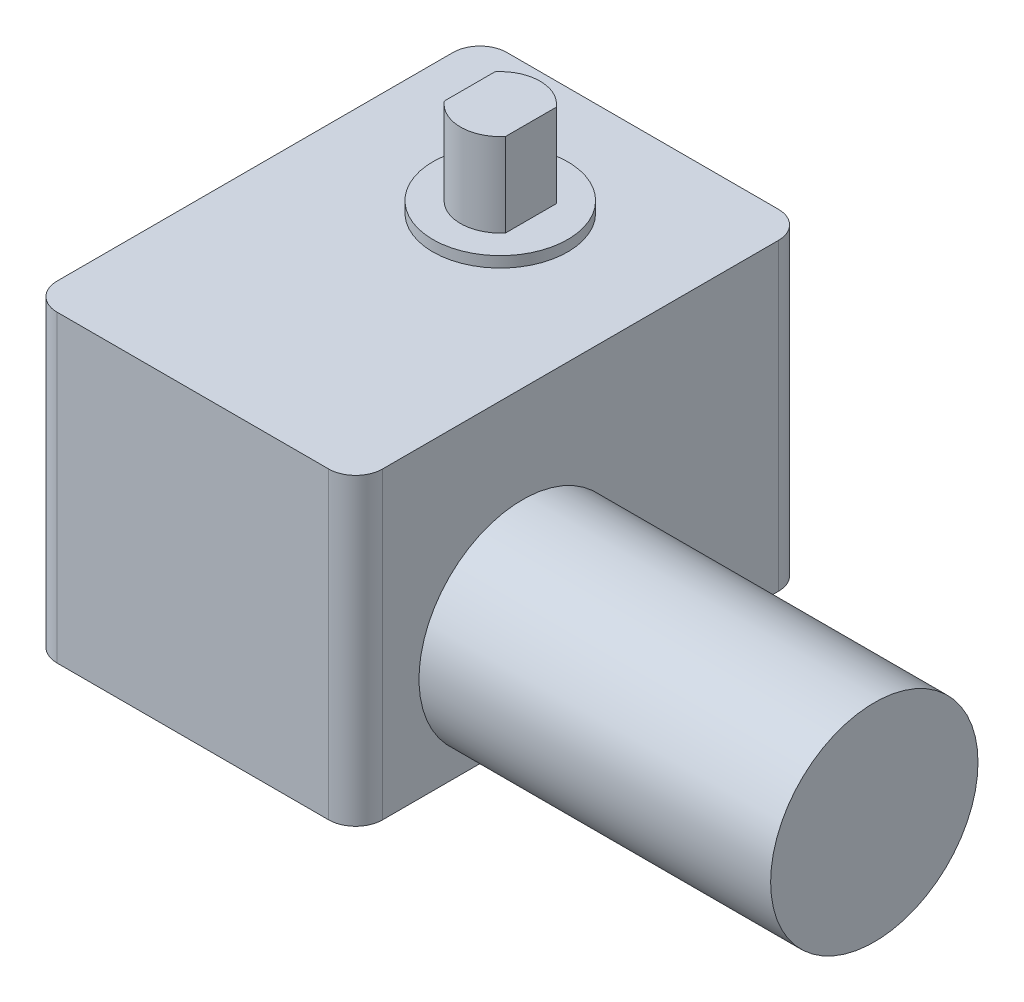
ISO-10303-21;
HEADER;
FILE_DESCRIPTION(('STEP AP214'),'2;1');
FILE_NAME('part.step','',(''),(''),'','','');
FILE_SCHEMA(('AUTOMOTIVE_DESIGN { 1 0 10303 214 1 1 1 1 }'));
ENDSEC;
DATA;
#1=APPLICATION_CONTEXT('core data for automotive mechanical design processes');
#2=APPLICATION_PROTOCOL_DEFINITION('international standard','automotive_design',2000,#1);
#3=PRODUCT_CONTEXT('',#1,'mechanical');
#4=PRODUCT('Part','Part','',(#3));
#5=PRODUCT_RELATED_PRODUCT_CATEGORY('part','',(#4));
#6=PRODUCT_DEFINITION_FORMATION('','',#4);
#7=PRODUCT_DEFINITION_CONTEXT('part definition',#1,'design');
#8=PRODUCT_DEFINITION('design','',#6,#7);
#9=PRODUCT_DEFINITION_SHAPE('','',#8);
#10=(LENGTH_UNIT() NAMED_UNIT(*) SI_UNIT(.MILLI.,.METRE.));
#11=(NAMED_UNIT(*) PLANE_ANGLE_UNIT() SI_UNIT($,.RADIAN.));
#12=(NAMED_UNIT(*) SI_UNIT($,.STERADIAN.) SOLID_ANGLE_UNIT());
#13=UNCERTAINTY_MEASURE_WITH_UNIT(LENGTH_MEASURE(1.E-05),#10,'distance_accuracy_value','');
#14=(GEOMETRIC_REPRESENTATION_CONTEXT(3) GLOBAL_UNCERTAINTY_ASSIGNED_CONTEXT((#13)) GLOBAL_UNIT_ASSIGNED_CONTEXT((#10,
#11,#12)) REPRESENTATION_CONTEXT('',''));
#15=CARTESIAN_POINT('',(0.,0.,0.));
#16=DIRECTION('',(0.,0.,1.));
#17=DIRECTION('',(1.,0.,0.));
#18=AXIS2_PLACEMENT_3D('',#15,#16,#17);
#19=CARTESIAN_POINT('',(25.11,0.,0.));
#20=DIRECTION('',(-1.,0.,0.));
#21=DIRECTION('',(0.,0.,1.));
#22=AXIS2_PLACEMENT_3D('',#19,#20,#21);
#23=PLANE('',#22);
#24=CARTESIAN_POINT('',(25.11,0.,-6.195));
#25=DIRECTION('',(1.,0.,0.));
#26=DIRECTION('',(0.,0.,-1.));
#27=AXIS2_PLACEMENT_3D('',#24,#25,#26);
#28=CIRCLE('',#27,3.845);
#29=CARTESIAN_POINT('',(25.11,0.,-10.04));
#30=VERTEX_POINT('',#29);
#31=EDGE_CURVE('E200',#30,#30,#28,.T.);
#32=ORIENTED_EDGE('',*,*,#31,.T.);
#33=EDGE_LOOP('',(#32));
#34=FACE_BOUND('',#33,.T.);
#35=ADVANCED_FACE('F34',(#34),#23,.F.);
#36=CARTESIAN_POINT('',(25.11,0.,-6.195));
#37=DIRECTION('',(1.,0.,0.));
#38=DIRECTION('',(0.,0.,-1.));
#39=AXIS2_PLACEMENT_3D('',#36,#37,#38);
#40=CYLINDRICAL_SURFACE('',#39,3.845);
#41=ORIENTED_EDGE('',*,*,#31,.F.);
#42=EDGE_LOOP('',(#41));
#43=FACE_BOUND('',#42,.T.);
#44=CARTESIAN_POINT('',(12.07,0.,-6.195));
#45=DIRECTION('',(1.,0.,0.));
#46=DIRECTION('',(0.,0.,-1.));
#47=AXIS2_PLACEMENT_3D('',#44,#45,#46);
#48=CIRCLE('',#47,3.845);
#49=CARTESIAN_POINT('',(12.07,-3.845,-6.195));
#50=VERTEX_POINT('',#49);
#51=EDGE_CURVE('E203',#50,#50,#48,.T.);
#52=ORIENTED_EDGE('',*,*,#51,.T.);
#53=EDGE_LOOP('',(#52));
#54=FACE_BOUND('',#53,.T.);
#55=ADVANCED_FACE('F274',(#43,#54),#40,.T.);
#56=CARTESIAN_POINT('',(12.07,-3.845,0.));
#57=DIRECTION('',(1.,0.,0.));
#58=DIRECTION('',(0.,0.,-1.));
#59=AXIS2_PLACEMENT_3D('',#56,#57,#58);
#60=PLANE('',#59);
#61=DIRECTION('',(0.,0.,-1.));
#62=VECTOR('',#61,1.);
#63=CARTESIAN_POINT('',(12.07,7.425,0.));
#64=LINE('',#63,#62);
#65=CARTESIAN_POINT('',(12.07,7.425,-1.));
#66=VERTEX_POINT('',#65);
#67=CARTESIAN_POINT('',(12.07,7.425,-15.68));
#68=VERTEX_POINT('',#67);
#69=EDGE_CURVE('E180',#66,#68,#64,.T.);
#70=ORIENTED_EDGE('',*,*,#69,.F.);
#71=DIRECTION('',(0.,1.,0.));
#72=VECTOR('',#71,1.);
#73=CARTESIAN_POINT('',(12.07,-3.845,-1.));
#74=LINE('',#73,#72);
#75=CARTESIAN_POINT('',(12.07,-3.845,-1.));
#76=VERTEX_POINT('',#75);
#77=EDGE_CURVE('E49',#66,#76,#74,.F.);
#78=ORIENTED_EDGE('',*,*,#77,.T.);
#79=DIRECTION('',(0.,0.,-1.));
#80=VECTOR('',#79,1.);
#81=CARTESIAN_POINT('',(12.07,-3.845,0.));
#82=LINE('',#81,#80);
#83=EDGE_CURVE('E193',#76,#50,#82,.T.);
#84=ORIENTED_EDGE('',*,*,#83,.T.);
#85=ORIENTED_EDGE('',*,*,#51,.F.);
#86=CARTESIAN_POINT('',(12.07,-3.845,-15.68));
#87=VERTEX_POINT('',#86);
#88=EDGE_CURVE('E192',#50,#87,#82,.T.);
#89=ORIENTED_EDGE('',*,*,#88,.T.);
#90=DIRECTION('',(0.,1.,0.));
#91=VECTOR('',#90,1.);
#92=CARTESIAN_POINT('',(12.07,7.425,-15.68));
#93=LINE('',#92,#91);
#94=EDGE_CURVE('E231',#87,#68,#93,.T.);
#95=ORIENTED_EDGE('',*,*,#94,.T.);
#96=EDGE_LOOP('',(#70,#78,#84,#85,#89,#95));
#97=FACE_BOUND('',#96,.T.);
#98=ADVANCED_FACE('F249',(#97),#60,.T.);
#99=CARTESIAN_POINT('',(0.,-3.845,0.));
#100=DIRECTION('',(0.,0.,1.));
#101=DIRECTION('',(1.,0.,0.));
#102=AXIS2_PLACEMENT_3D('',#99,#100,#101);
#103=PLANE('',#102);
#104=DIRECTION('',(1.,0.,0.));
#105=VECTOR('',#104,1.);
#106=CARTESIAN_POINT('',(0.,7.425,0.));
#107=LINE('',#106,#105);
#108=CARTESIAN_POINT('',(1.,7.425,0.));
#109=VERTEX_POINT('',#108);
#110=CARTESIAN_POINT('',(11.07,7.425,0.));
#111=VERTEX_POINT('',#110);
#112=EDGE_CURVE('E177',#109,#111,#107,.T.);
#113=ORIENTED_EDGE('',*,*,#112,.F.);
#114=DIRECTION('',(0.,1.,0.));
#115=VECTOR('',#114,1.);
#116=CARTESIAN_POINT('',(1.,-3.845,0.));
#117=LINE('',#116,#115);
#118=CARTESIAN_POINT('',(1.,-3.845,0.));
#119=VERTEX_POINT('',#118);
#120=EDGE_CURVE('E222',#109,#119,#117,.F.);
#121=ORIENTED_EDGE('',*,*,#120,.T.);
#122=DIRECTION('',(1.,0.,0.));
#123=VECTOR('',#122,1.);
#124=CARTESIAN_POINT('',(0.,-3.845,0.));
#125=LINE('',#124,#123);
#126=CARTESIAN_POINT('',(11.07,-3.845,0.));
#127=VERTEX_POINT('',#126);
#128=EDGE_CURVE('E189',#119,#127,#125,.T.);
#129=ORIENTED_EDGE('',*,*,#128,.T.);
#130=DIRECTION('',(0.,1.,0.));
#131=VECTOR('',#130,1.);
#132=CARTESIAN_POINT('',(11.07,-3.845,0.));
#133=LINE('',#132,#131);
#134=EDGE_CURVE('E219',#127,#111,#133,.T.);
#135=ORIENTED_EDGE('',*,*,#134,.T.);
#136=EDGE_LOOP('',(#113,#121,#129,#135));
#137=FACE_BOUND('',#136,.T.);
#138=ADVANCED_FACE('F259',(#137),#103,.T.);
#139=CARTESIAN_POINT('',(0.,-3.845,0.));
#140=DIRECTION('',(1.,0.,0.));
#141=DIRECTION('',(0.,0.,-1.));
#142=AXIS2_PLACEMENT_3D('',#139,#140,#141);
#143=PLANE('',#142);
#144=DIRECTION('',(0.,0.,-1.));
#145=VECTOR('',#144,1.);
#146=CARTESIAN_POINT('',(0.,-3.845,0.));
#147=LINE('',#146,#145);
#148=CARTESIAN_POINT('',(0.,-3.845,-1.));
#149=VERTEX_POINT('',#148);
#150=CARTESIAN_POINT('',(0.,-3.845,-15.68));
#151=VERTEX_POINT('',#150);
#152=EDGE_CURVE('E197',#149,#151,#147,.T.);
#153=ORIENTED_EDGE('',*,*,#152,.F.);
#154=DIRECTION('',(0.,1.,0.));
#155=VECTOR('',#154,1.);
#156=CARTESIAN_POINT('',(0.,7.425,-1.));
#157=LINE('',#156,#155);
#158=CARTESIAN_POINT('',(0.,7.425,-1.));
#159=VERTEX_POINT('',#158);
#160=EDGE_CURVE('E208',#149,#159,#157,.T.);
#161=ORIENTED_EDGE('',*,*,#160,.T.);
#162=DIRECTION('',(0.,0.,-1.));
#163=VECTOR('',#162,1.);
#164=CARTESIAN_POINT('',(0.,7.425,0.));
#165=LINE('',#164,#163);
#166=CARTESIAN_POINT('',(0.,7.425,-15.68));
#167=VERTEX_POINT('',#166);
#168=EDGE_CURVE('E186',#159,#167,#165,.T.);
#169=ORIENTED_EDGE('',*,*,#168,.T.);
#170=DIRECTION('',(0.,1.,0.));
#171=VECTOR('',#170,1.);
#172=CARTESIAN_POINT('',(0.,-3.845,-15.68));
#173=LINE('',#172,#171);
#174=EDGE_CURVE('E206',#167,#151,#173,.F.);
#175=ORIENTED_EDGE('',*,*,#174,.T.);
#176=EDGE_LOOP('',(#153,#161,#169,#175));
#177=FACE_BOUND('',#176,.T.);
#178=ADVANCED_FACE('F267',(#177),#143,.F.);
#179=CARTESIAN_POINT('',(0.,-3.845,-16.68));
#180=DIRECTION('',(0.,0.,1.));
#181=DIRECTION('',(1.,0.,0.));
#182=AXIS2_PLACEMENT_3D('',#179,#180,#181);
#183=PLANE('',#182);
#184=DIRECTION('',(1.,0.,0.));
#185=VECTOR('',#184,1.);
#186=CARTESIAN_POINT('',(0.,7.425,-16.68));
#187=LINE('',#186,#185);
#188=CARTESIAN_POINT('',(1.,7.425,-16.68));
#189=VERTEX_POINT('',#188);
#190=CARTESIAN_POINT('',(11.07,7.425,-16.68));
#191=VERTEX_POINT('',#190);
#192=EDGE_CURVE('E183',#189,#191,#187,.T.);
#193=ORIENTED_EDGE('',*,*,#192,.T.);
#194=DIRECTION('',(0.,1.,0.));
#195=VECTOR('',#194,1.);
#196=CARTESIAN_POINT('',(11.07,-3.845,-16.68));
#197=LINE('',#196,#195);
#198=CARTESIAN_POINT('',(11.07,-3.845,-16.68));
#199=VERTEX_POINT('',#198);
#200=EDGE_CURVE('E11',#191,#199,#197,.F.);
#201=ORIENTED_EDGE('',*,*,#200,.T.);
#202=DIRECTION('',(1.,0.,0.));
#203=VECTOR('',#202,1.);
#204=CARTESIAN_POINT('',(0.,-3.845,-16.68));
#205=LINE('',#204,#203);
#206=CARTESIAN_POINT('',(1.,-3.845,-16.68));
#207=VERTEX_POINT('',#206);
#208=EDGE_CURVE('E195',#207,#199,#205,.T.);
#209=ORIENTED_EDGE('',*,*,#208,.F.);
#210=DIRECTION('',(0.,1.,0.));
#211=VECTOR('',#210,1.);
#212=CARTESIAN_POINT('',(1.,-3.845,-16.68));
#213=LINE('',#212,#211);
#214=EDGE_CURVE('E42',#207,#189,#213,.T.);
#215=ORIENTED_EDGE('',*,*,#214,.T.);
#216=EDGE_LOOP('',(#193,#201,#209,#215));
#217=FACE_BOUND('',#216,.T.);
#218=ADVANCED_FACE('F239',(#217),#183,.F.);
#219=CARTESIAN_POINT('',(0.,-3.845,0.));
#220=DIRECTION('',(0.,1.,0.));
#221=DIRECTION('',(0.,0.,1.));
#222=AXIS2_PLACEMENT_3D('',#219,#220,#221);
#223=PLANE('',#222);
#224=ORIENTED_EDGE('',*,*,#128,.F.);
#225=CARTESIAN_POINT('',(1.,-3.845,-1.));
#226=DIRECTION('',(0.,1.,0.));
#227=DIRECTION('',(0.,0.,1.));
#228=AXIS2_PLACEMENT_3D('',#225,#226,#227);
#229=CIRCLE('',#228,1.);
#230=EDGE_CURVE('E229',#119,#149,#229,.F.);
#231=ORIENTED_EDGE('',*,*,#230,.T.);
#232=ORIENTED_EDGE('',*,*,#152,.T.);
#233=CARTESIAN_POINT('',(1.,-3.845,-15.68));
#234=DIRECTION('',(0.,1.,0.));
#235=DIRECTION('',(0.,0.,1.));
#236=AXIS2_PLACEMENT_3D('',#233,#234,#235);
#237=CIRCLE('',#236,1.);
#238=EDGE_CURVE('E224',#151,#207,#237,.F.);
#239=ORIENTED_EDGE('',*,*,#238,.T.);
#240=ORIENTED_EDGE('',*,*,#208,.T.);
#241=CARTESIAN_POINT('',(11.07,-3.845,-15.68));
#242=DIRECTION('',(0.,1.,0.));
#243=DIRECTION('',(0.,0.,1.));
#244=AXIS2_PLACEMENT_3D('',#241,#242,#243);
#245=CIRCLE('',#244,1.);
#246=EDGE_CURVE('E57',#199,#87,#245,.F.);
#247=ORIENTED_EDGE('',*,*,#246,.T.);
#248=ORIENTED_EDGE('',*,*,#88,.F.);
#249=ORIENTED_EDGE('',*,*,#83,.F.);
#250=CARTESIAN_POINT('',(11.07,-3.845,-1.));
#251=DIRECTION('',(0.,1.,0.));
#252=DIRECTION('',(0.,0.,1.));
#253=AXIS2_PLACEMENT_3D('',#250,#251,#252);
#254=CIRCLE('',#253,1.);
#255=EDGE_CURVE('E227',#76,#127,#254,.F.);
#256=ORIENTED_EDGE('',*,*,#255,.T.);
#257=EDGE_LOOP('',(#224,#231,#232,#239,#240,#247,#248,#249,#256));
#258=FACE_BOUND('',#257,.T.);
#259=ADVANCED_FACE('F252',(#258),#223,.F.);
#260=CARTESIAN_POINT('',(0.,7.425,0.));
#261=DIRECTION('',(0.,1.,0.));
#262=DIRECTION('',(0.,0.,1.));
#263=AXIS2_PLACEMENT_3D('',#260,#261,#262);
#264=PLANE('',#263);
#265=CARTESIAN_POINT('',(6.035,7.425,-11.4));
#266=DIRECTION('',(0.,1.,0.));
#267=DIRECTION('',(0.,0.,1.));
#268=AXIS2_PLACEMENT_3D('',#265,#266,#267);
#269=CIRCLE('',#268,2.5);
#270=CARTESIAN_POINT('',(6.035,7.425,-8.9));
#271=VERTEX_POINT('',#270);
#272=EDGE_CURVE('E174',#271,#271,#269,.T.);
#273=ORIENTED_EDGE('',*,*,#272,.F.);
#274=EDGE_LOOP('',(#273));
#275=FACE_BOUND('',#274,.T.);
#276=ORIENTED_EDGE('',*,*,#168,.F.);
#277=CARTESIAN_POINT('',(1.,7.425,-1.));
#278=DIRECTION('',(0.,1.,0.));
#279=DIRECTION('',(0.,0.,1.));
#280=AXIS2_PLACEMENT_3D('',#277,#278,#279);
#281=CIRCLE('',#280,1.);
#282=EDGE_CURVE('E217',#159,#109,#281,.T.);
#283=ORIENTED_EDGE('',*,*,#282,.T.);
#284=ORIENTED_EDGE('',*,*,#112,.T.);
#285=CARTESIAN_POINT('',(11.07,7.425,-1.));
#286=DIRECTION('',(0.,1.,0.));
#287=DIRECTION('',(0.,0.,1.));
#288=AXIS2_PLACEMENT_3D('',#285,#286,#287);
#289=CIRCLE('',#288,1.);
#290=EDGE_CURVE('E215',#111,#66,#289,.T.);
#291=ORIENTED_EDGE('',*,*,#290,.T.);
#292=ORIENTED_EDGE('',*,*,#69,.T.);
#293=CARTESIAN_POINT('',(11.07,7.425,-15.68));
#294=DIRECTION('',(0.,1.,0.));
#295=DIRECTION('',(0.,0.,1.));
#296=AXIS2_PLACEMENT_3D('',#293,#294,#295);
#297=CIRCLE('',#296,1.);
#298=EDGE_CURVE('E213',#68,#191,#297,.T.);
#299=ORIENTED_EDGE('',*,*,#298,.T.);
#300=ORIENTED_EDGE('',*,*,#192,.F.);
#301=CARTESIAN_POINT('',(1.,7.425,-15.68));
#302=DIRECTION('',(0.,1.,0.));
#303=DIRECTION('',(0.,0.,1.));
#304=AXIS2_PLACEMENT_3D('',#301,#302,#303);
#305=CIRCLE('',#304,1.);
#306=EDGE_CURVE('E211',#189,#167,#305,.T.);
#307=ORIENTED_EDGE('',*,*,#306,.T.);
#308=EDGE_LOOP('',(#276,#283,#284,#291,#292,#299,#300,#307));
#309=FACE_BOUND('',#308,.T.);
#310=ADVANCED_FACE('F245',(#275,#309),#264,.T.);
#311=CARTESIAN_POINT('',(6.035,7.825,-11.4));
#312=DIRECTION('',(0.,-1.,0.));
#313=DIRECTION('',(0.,0.,-1.));
#314=AXIS2_PLACEMENT_3D('',#311,#312,#313);
#315=CYLINDRICAL_SURFACE('',#314,2.5);
#316=ORIENTED_EDGE('',*,*,#272,.T.);
#317=EDGE_LOOP('',(#316));
#318=FACE_BOUND('',#317,.T.);
#319=CARTESIAN_POINT('',(6.035,7.825,-11.4));
#320=DIRECTION('',(0.,1.,0.));
#321=DIRECTION('',(0.,0.,1.));
#322=AXIS2_PLACEMENT_3D('',#319,#320,#321);
#323=CIRCLE('',#322,2.5);
#324=CARTESIAN_POINT('',(6.035,7.825,-8.9));
#325=VERTEX_POINT('',#324);
#326=EDGE_CURVE('E171',#325,#325,#323,.T.);
#327=ORIENTED_EDGE('',*,*,#326,.F.);
#328=EDGE_LOOP('',(#327));
#329=FACE_BOUND('',#328,.T.);
#330=ADVANCED_FACE('F357',(#318,#329),#315,.T.);
#331=CARTESIAN_POINT('',(0.,7.825,0.));
#332=DIRECTION('',(0.,1.,0.));
#333=DIRECTION('',(0.,0.,1.));
#334=AXIS2_PLACEMENT_3D('',#331,#332,#333);
#335=PLANE('',#334);
#336=CARTESIAN_POINT('',(6.035,7.825,-11.4));
#337=DIRECTION('',(0.,1.,0.));
#338=DIRECTION('',(0.,0.,1.));
#339=AXIS2_PLACEMENT_3D('',#336,#337,#338);
#340=CIRCLE('',#339,1.475);
#341=CARTESIAN_POINT('',(7.17167277613216,7.825,-12.34));
#342=VERTEX_POINT('',#341);
#343=CARTESIAN_POINT('',(4.89832722386784,7.825,-12.34));
#344=VERTEX_POINT('',#343);
#345=EDGE_CURVE('E138',#342,#344,#340,.T.);
#346=ORIENTED_EDGE('',*,*,#345,.F.);
#347=DIRECTION('',(0.,0.,1.));
#348=VECTOR('',#347,1.);
#349=CARTESIAN_POINT('',(7.17167277613217,7.825,0.));
#350=LINE('',#349,#348);
#351=CARTESIAN_POINT('',(7.17167277613217,7.825,-10.46));
#352=VERTEX_POINT('',#351);
#353=EDGE_CURVE('E135',#342,#352,#350,.T.);
#354=ORIENTED_EDGE('',*,*,#353,.T.);
#355=CARTESIAN_POINT('',(6.035,7.825,-11.4));
#356=DIRECTION('',(0.,1.,0.));
#357=DIRECTION('',(0.,0.,1.));
#358=AXIS2_PLACEMENT_3D('',#355,#356,#357);
#359=CIRCLE('',#358,1.475);
#360=CARTESIAN_POINT('',(4.89832722386784,7.825,-10.46));
#361=VERTEX_POINT('',#360);
#362=EDGE_CURVE('E165',#361,#352,#359,.T.);
#363=ORIENTED_EDGE('',*,*,#362,.F.);
#364=DIRECTION('',(0.,0.,1.));
#365=VECTOR('',#364,1.);
#366=CARTESIAN_POINT('',(4.89832722386784,7.825,0.));
#367=LINE('',#366,#365);
#368=EDGE_CURVE('E168',#344,#361,#367,.T.);
#369=ORIENTED_EDGE('',*,*,#368,.F.);
#370=EDGE_LOOP('',(#346,#354,#363,#369));
#371=FACE_BOUND('',#370,.T.);
#372=ORIENTED_EDGE('',*,*,#326,.T.);
#373=EDGE_LOOP('',(#372));
#374=FACE_BOUND('',#373,.T.);
#375=ADVANCED_FACE('F349',(#371,#374),#335,.T.);
#376=CARTESIAN_POINT('',(7.17167277613217,10.925,0.));
#377=DIRECTION('',(1.,0.,0.));
#378=DIRECTION('',(0.,0.,-1.));
#379=AXIS2_PLACEMENT_3D('',#376,#377,#378);
#380=PLANE('',#379);
#381=DIRECTION('',(0.,-1.,0.));
#382=VECTOR('',#381,1.);
#383=CARTESIAN_POINT('',(7.17167277613217,10.925,-10.46));
#384=LINE('',#383,#382);
#385=CARTESIAN_POINT('',(7.17167277613217,10.925,-10.46));
#386=VERTEX_POINT('',#385);
#387=EDGE_CURVE('E157',#386,#352,#384,.T.);
#388=ORIENTED_EDGE('',*,*,#387,.T.);
#389=ORIENTED_EDGE('',*,*,#353,.F.);
#390=DIRECTION('',(0.,-1.,0.));
#391=VECTOR('',#390,1.);
#392=CARTESIAN_POINT('',(7.17167277613216,10.925,-12.34));
#393=LINE('',#392,#391);
#394=CARTESIAN_POINT('',(7.17167277613216,10.925,-12.34));
#395=VERTEX_POINT('',#394);
#396=EDGE_CURVE('E129',#395,#342,#393,.T.);
#397=ORIENTED_EDGE('',*,*,#396,.F.);
#398=DIRECTION('',(0.,0.,1.));
#399=VECTOR('',#398,1.);
#400=CARTESIAN_POINT('',(7.17167277613217,10.925,0.));
#401=LINE('',#400,#399);
#402=EDGE_CURVE('E134',#395,#386,#401,.T.);
#403=ORIENTED_EDGE('',*,*,#402,.T.);
#404=EDGE_LOOP('',(#388,#389,#397,#403));
#405=FACE_BOUND('',#404,.T.);
#406=ADVANCED_FACE('F132',(#405),#380,.T.);
#407=CARTESIAN_POINT('',(6.035,10.925,-11.4));
#408=DIRECTION('',(0.,-1.,0.));
#409=DIRECTION('',(0.,0.,-1.));
#410=AXIS2_PLACEMENT_3D('',#407,#408,#409);
#411=CYLINDRICAL_SURFACE('',#410,1.475);
#412=ORIENTED_EDGE('',*,*,#345,.T.);
#413=DIRECTION('',(0.,-1.,0.));
#414=VECTOR('',#413,1.);
#415=CARTESIAN_POINT('',(4.89832722386784,10.925,-12.34));
#416=LINE('',#415,#414);
#417=CARTESIAN_POINT('',(4.89832722386784,10.925,-12.34));
#418=VERTEX_POINT('',#417);
#419=EDGE_CURVE('E139',#418,#344,#416,.T.);
#420=ORIENTED_EDGE('',*,*,#419,.F.);
#421=CARTESIAN_POINT('',(6.035,10.925,-11.4));
#422=DIRECTION('',(0.,1.,0.));
#423=DIRECTION('',(0.,0.,1.));
#424=AXIS2_PLACEMENT_3D('',#421,#422,#423);
#425=CIRCLE('',#424,1.475);
#426=EDGE_CURVE('E142',#395,#418,#425,.T.);
#427=ORIENTED_EDGE('',*,*,#426,.F.);
#428=ORIENTED_EDGE('',*,*,#396,.T.);
#429=EDGE_LOOP('',(#412,#420,#427,#428));
#430=FACE_BOUND('',#429,.T.);
#431=ADVANCED_FACE('F143',(#430),#411,.T.);
#432=CARTESIAN_POINT('',(4.89832722386784,10.925,0.));
#433=DIRECTION('',(1.,0.,0.));
#434=DIRECTION('',(0.,0.,-1.));
#435=AXIS2_PLACEMENT_3D('',#432,#433,#434);
#436=PLANE('',#435);
#437=ORIENTED_EDGE('',*,*,#368,.T.);
#438=DIRECTION('',(0.,-1.,0.));
#439=VECTOR('',#438,1.);
#440=CARTESIAN_POINT('',(4.89832722386784,10.925,-10.46));
#441=LINE('',#440,#439);
#442=CARTESIAN_POINT('',(4.89832722386784,10.925,-10.46));
#443=VERTEX_POINT('',#442);
#444=EDGE_CURVE('E159',#443,#361,#441,.T.);
#445=ORIENTED_EDGE('',*,*,#444,.F.);
#446=DIRECTION('',(0.,0.,1.));
#447=VECTOR('',#446,1.);
#448=CARTESIAN_POINT('',(4.89832722386784,10.925,0.));
#449=LINE('',#448,#447);
#450=EDGE_CURVE('E147',#418,#443,#449,.T.);
#451=ORIENTED_EDGE('',*,*,#450,.F.);
#452=ORIENTED_EDGE('',*,*,#419,.T.);
#453=EDGE_LOOP('',(#437,#445,#451,#452));
#454=FACE_BOUND('',#453,.T.);
#455=ADVANCED_FACE('F325',(#454),#436,.F.);
#456=CARTESIAN_POINT('',(6.035,10.925,-11.4));
#457=DIRECTION('',(0.,-1.,0.));
#458=DIRECTION('',(0.,0.,-1.));
#459=AXIS2_PLACEMENT_3D('',#456,#457,#458);
#460=CYLINDRICAL_SURFACE('',#459,1.475);
#461=ORIENTED_EDGE('',*,*,#362,.T.);
#462=ORIENTED_EDGE('',*,*,#387,.F.);
#463=CARTESIAN_POINT('',(6.035,10.925,-11.4));
#464=DIRECTION('',(0.,1.,0.));
#465=DIRECTION('',(0.,0.,1.));
#466=AXIS2_PLACEMENT_3D('',#463,#464,#465);
#467=CIRCLE('',#466,1.475);
#468=EDGE_CURVE('E151',#443,#386,#467,.T.);
#469=ORIENTED_EDGE('',*,*,#468,.F.);
#470=ORIENTED_EDGE('',*,*,#444,.T.);
#471=EDGE_LOOP('',(#461,#462,#469,#470));
#472=FACE_BOUND('',#471,.T.);
#473=ADVANCED_FACE('F316',(#472),#460,.T.);
#474=CARTESIAN_POINT('',(0.,10.925,0.));
#475=DIRECTION('',(0.,1.,0.));
#476=DIRECTION('',(0.,0.,1.));
#477=AXIS2_PLACEMENT_3D('',#474,#475,#476);
#478=PLANE('',#477);
#479=ORIENTED_EDGE('',*,*,#402,.F.);
#480=ORIENTED_EDGE('',*,*,#426,.T.);
#481=ORIENTED_EDGE('',*,*,#450,.T.);
#482=ORIENTED_EDGE('',*,*,#468,.T.);
#483=EDGE_LOOP('',(#479,#480,#481,#482));
#484=FACE_BOUND('',#483,.T.);
#485=ADVANCED_FACE('F149',(#484),#478,.T.);
#486=CARTESIAN_POINT('',(1.,-3.845,-1.));
#487=DIRECTION('',(0.,-1.,0.));
#488=DIRECTION('',(0.,0.,-1.));
#489=AXIS2_PLACEMENT_3D('',#486,#487,#488);
#490=CYLINDRICAL_SURFACE('',#489,1.);
#491=ORIENTED_EDGE('',*,*,#230,.F.);
#492=ORIENTED_EDGE('',*,*,#120,.F.);
#493=ORIENTED_EDGE('',*,*,#282,.F.);
#494=ORIENTED_EDGE('',*,*,#160,.F.);
#495=EDGE_LOOP('',(#491,#492,#493,#494));
#496=FACE_BOUND('',#495,.T.);
#497=ADVANCED_FACE('F264',(#496),#490,.T.);
#498=CARTESIAN_POINT('',(11.07,-3.845,-1.));
#499=DIRECTION('',(0.,1.,0.));
#500=DIRECTION('',(0.,0.,1.));
#501=AXIS2_PLACEMENT_3D('',#498,#499,#500);
#502=CYLINDRICAL_SURFACE('',#501,1.);
#503=ORIENTED_EDGE('',*,*,#255,.F.);
#504=ORIENTED_EDGE('',*,*,#77,.F.);
#505=ORIENTED_EDGE('',*,*,#290,.F.);
#506=ORIENTED_EDGE('',*,*,#134,.F.);
#507=EDGE_LOOP('',(#503,#504,#505,#506));
#508=FACE_BOUND('',#507,.T.);
#509=ADVANCED_FACE('F256',(#508),#502,.T.);
#510=CARTESIAN_POINT('',(11.07,-3.845,-15.68));
#511=DIRECTION('',(0.,-1.,0.));
#512=DIRECTION('',(0.,0.,-1.));
#513=AXIS2_PLACEMENT_3D('',#510,#511,#512);
#514=CYLINDRICAL_SURFACE('',#513,1.);
#515=ORIENTED_EDGE('',*,*,#246,.F.);
#516=ORIENTED_EDGE('',*,*,#200,.F.);
#517=ORIENTED_EDGE('',*,*,#298,.F.);
#518=ORIENTED_EDGE('',*,*,#94,.F.);
#519=EDGE_LOOP('',(#515,#516,#517,#518));
#520=FACE_BOUND('',#519,.T.);
#521=ADVANCED_FACE('F248',(#520),#514,.T.);
#522=CARTESIAN_POINT('',(1.,-3.845,-15.68));
#523=DIRECTION('',(0.,1.,0.));
#524=DIRECTION('',(0.,0.,1.));
#525=AXIS2_PLACEMENT_3D('',#522,#523,#524);
#526=CYLINDRICAL_SURFACE('',#525,1.);
#527=ORIENTED_EDGE('',*,*,#238,.F.);
#528=ORIENTED_EDGE('',*,*,#174,.F.);
#529=ORIENTED_EDGE('',*,*,#306,.F.);
#530=ORIENTED_EDGE('',*,*,#214,.F.);
#531=EDGE_LOOP('',(#527,#528,#529,#530));
#532=FACE_BOUND('',#531,.T.);
#533=ADVANCED_FACE('F36',(#532),#526,.T.);
#534=CLOSED_SHELL('',(#35,#55,#98,#138,#178,#218,#259,#310,#330,#375,#406,#431,#455,#473,#485,
#497,#509,#521,#533));
#535=MANIFOLD_SOLID_BREP('B2',#534);
#536=ADVANCED_BREP_SHAPE_REPRESENTATION('',(#18,#535),#14);
#537=SHAPE_DEFINITION_REPRESENTATION(#9,#536);
ENDSEC;
END-ISO-10303-21;
